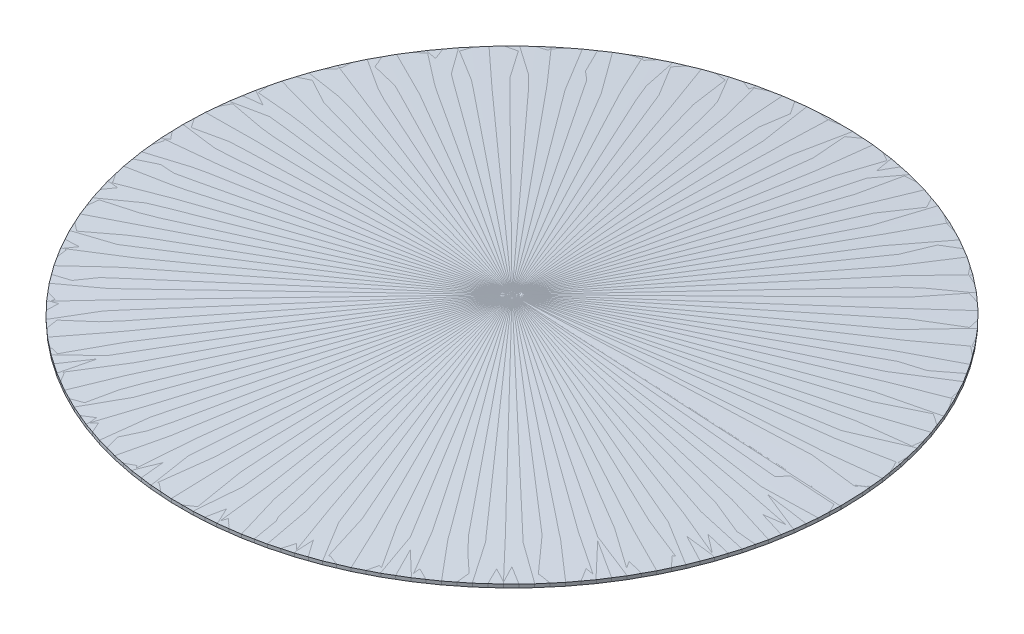
ISO-10303-21;
HEADER;
FILE_DESCRIPTION(('STEP AP214'),'2;1');
FILE_NAME('part.step','',(''),(''),'','','');
FILE_SCHEMA(('AUTOMOTIVE_DESIGN { 1 0 10303 214 1 1 1 1 }'));
ENDSEC;
DATA;
#1=APPLICATION_CONTEXT('core data for automotive mechanical design processes');
#2=APPLICATION_PROTOCOL_DEFINITION('international standard','automotive_design',2000,#1);
#3=PRODUCT_CONTEXT('',#1,'mechanical');
#4=PRODUCT('Part','Part','',(#3));
#5=PRODUCT_RELATED_PRODUCT_CATEGORY('part','',(#4));
#6=PRODUCT_DEFINITION_FORMATION('','',#4);
#7=PRODUCT_DEFINITION_CONTEXT('part definition',#1,'design');
#8=PRODUCT_DEFINITION('design','',#6,#7);
#9=PRODUCT_DEFINITION_SHAPE('','',#8);
#10=(LENGTH_UNIT() NAMED_UNIT(*) SI_UNIT(.MILLI.,.METRE.));
#11=(NAMED_UNIT(*) PLANE_ANGLE_UNIT() SI_UNIT($,.RADIAN.));
#12=(NAMED_UNIT(*) SI_UNIT($,.STERADIAN.) SOLID_ANGLE_UNIT());
#13=UNCERTAINTY_MEASURE_WITH_UNIT(LENGTH_MEASURE(1.E-05),#10,'distance_accuracy_value','');
#14=(GEOMETRIC_REPRESENTATION_CONTEXT(3) GLOBAL_UNCERTAINTY_ASSIGNED_CONTEXT((#13)) GLOBAL_UNIT_ASSIGNED_CONTEXT((#10,
#11,#12)) REPRESENTATION_CONTEXT('',''));
#15=CARTESIAN_POINT('',(0.,0.,0.));
#16=DIRECTION('',(0.,0.,1.));
#17=DIRECTION('',(1.,0.,0.));
#18=AXIS2_PLACEMENT_3D('',#15,#16,#17);
#19=CARTESIAN_POINT('',(0.,0.995884612293751,0.));
#20=DIRECTION('',(0.,1.,0.));
#21=DIRECTION('',(0.,0.,1.));
#22=AXIS2_PLACEMENT_3D('',#19,#20,#21);
#23=CONICAL_SURFACE('',#22,0.103542390211317,0.0535680057134327);
#24=DIRECTION('',(0.0535420640127607,0.998565577441191,0.00018689782016487));
#25=VECTOR('',#24,1.);
#26=CARTESIAN_POINT('',(0.103541759395643,0.995884612293751,0.000361430390925328));
#27=LINE('',#26,#25);
#28=CARTESIAN_POINT('',(0.0499996953828852,-0.00268096514743216,0.000174532570760525));
#29=VERTEX_POINT('',#28);
#30=CARTESIAN_POINT('',(0.157083823408427,1.99445018973495,0.000548328211090205));
#31=VERTEX_POINT('',#30);
#32=EDGE_CURVE('E12',#29,#31,#27,.T.);
#33=ORIENTED_EDGE('',*,*,#32,.F.);
#34=CARTESIAN_POINT('',(0.,-0.00268096514743216,0.));
#35=DIRECTION('',(0.,-1.,0.));
#36=DIRECTION('',(0.,0.,-1.));
#37=AXIS2_PLACEMENT_3D('',#34,#35,#36);
#38=CIRCLE('',#37,0.0499999999999945);
#39=CARTESIAN_POINT('',(0.0499999999999945,-0.00268096514743216,0.));
#40=VERTEX_POINT('',#39);
#41=EDGE_CURVE('E111',#29,#40,#38,.T.);
#42=ORIENTED_EDGE('',*,*,#41,.T.);
#43=DIRECTION('',(0.0535423902113246,0.998565577441191,0.));
#44=VECTOR('',#43,1.);
#45=CARTESIAN_POINT('',(0.10354239021131,0.995884612293752,0.));
#46=LINE('',#45,#44);
#47=CARTESIAN_POINT('',(0.157084780422645,1.99445018973495,0.));
#48=VERTEX_POINT('',#47);
#49=EDGE_CURVE('E59',#40,#48,#46,.T.);
#50=ORIENTED_EDGE('',*,*,#49,.T.);
#51=CARTESIAN_POINT('',(0.,1.99445018973495,0.));
#52=DIRECTION('',(0.,-1.,0.));
#53=DIRECTION('',(0.,0.,-1.));
#54=AXIS2_PLACEMENT_3D('',#51,#52,#53);
#55=CIRCLE('',#54,0.157084780422645);
#56=EDGE_CURVE('E105',#31,#48,#55,.T.);
#57=ORIENTED_EDGE('',*,*,#56,.F.);
#58=EDGE_LOOP('',(#33,#42,#50,#57));
#59=FACE_BOUND('',#58,.T.);
#60=ADVANCED_FACE('F49',(#59),#23,.F.);
#61=CARTESIAN_POINT('',(0.10354239021131,0.995884612293752,0.));
#62=DIRECTION('',(0.,0.,1.));
#63=DIRECTION('',(0.998565577441191,-0.0535423902113239,0.));
#64=AXIS2_PLACEMENT_3D('',#61,#62,#63);
#65=PLANE('',#64);
#66=ORIENTED_EDGE('',*,*,#49,.F.);
#67=DIRECTION('',(0.998565577441191,-0.0535423902113246,0.));
#68=VECTOR('',#67,1.);
#69=CARTESIAN_POINT('',(187.535423902113,-10.0555187078882,4.98546426034474E-12));
#70=LINE('',#69,#68);
#71=CARTESIAN_POINT('',(186.5,-10.0000000000001,4.95793842682015E-12));
#72=VERTEX_POINT('',#71);
#73=EDGE_CURVE('E93',#40,#72,#70,.T.);
#74=ORIENTED_EDGE('',*,*,#73,.T.);
#75=DIRECTION('',(0.0535423902113246,0.998565577441191,0.));
#76=VECTOR('',#75,1.);
#77=CARTESIAN_POINT('',(186.553542390211,-9.00143442255881,4.98220802401584E-12));
#78=LINE('',#77,#76);
#79=CARTESIAN_POINT('',(186.607084780423,-8.00286884511773,4.96078518149996E-12));
#80=VERTEX_POINT('',#79);
#81=EDGE_CURVE('E88',#72,#80,#78,.T.);
#82=ORIENTED_EDGE('',*,*,#81,.T.);
#83=DIRECTION('',(0.998565577441191,-0.0535423902113246,0.));
#84=VECTOR('',#83,1.);
#85=CARTESIAN_POINT('',(187.642508682536,-8.05838755300584,4.98831101502455E-12));
#86=LINE('',#85,#84);
#87=EDGE_CURVE('E91',#48,#80,#86,.T.);
#88=ORIENTED_EDGE('',*,*,#87,.F.);
#89=EDGE_LOOP('',(#66,#74,#82,#88));
#90=FACE_BOUND('',#89,.T.);
#91=ADVANCED_FACE('F90',(#90),#65,.T.);
#92=CARTESIAN_POINT('',(0.,-9.00143442255881,0.));
#93=DIRECTION('',(0.,1.,0.));
#94=DIRECTION('',(0.,0.,1.));
#95=AXIS2_PLACEMENT_3D('',#92,#93,#94);
#96=CONICAL_SURFACE('',#95,186.553542390211,0.0535680057134327);
#97=ORIENTED_EDGE('',*,*,#81,.F.);
#98=CARTESIAN_POINT('',(0.,-10.0000000000001,0.));
#99=DIRECTION('',(0.,-1.,0.));
#100=DIRECTION('',(0.,0.,-1.));
#101=AXIS2_PLACEMENT_3D('',#98,#99,#100);
#102=CIRCLE('',#101,186.5);
#103=CARTESIAN_POINT('',(186.498863778178,-10.0000000000001,0.651006488936565));
#104=VERTEX_POINT('',#103);
#105=EDGE_CURVE('E117',#72,#104,#102,.F.);
#106=ORIENTED_EDGE('',*,*,#105,.T.);
#107=DIRECTION('',(0.0535420640127607,0.998565577441191,0.000186897820164852));
#108=VECTOR('',#107,1.);
#109=CARTESIAN_POINT('',(186.552405842191,-9.00143442255881,0.651193386756711));
#110=LINE('',#109,#108);
#111=CARTESIAN_POINT('',(186.605947906203,-8.00286884511773,0.651380284576895));
#112=VERTEX_POINT('',#111);
#113=EDGE_CURVE('E53',#104,#112,#110,.T.);
#114=ORIENTED_EDGE('',*,*,#113,.T.);
#115=CARTESIAN_POINT('',(0.,-8.00286884511773,0.));
#116=DIRECTION('',(0.,-1.,0.));
#117=DIRECTION('',(0.,0.,-1.));
#118=AXIS2_PLACEMENT_3D('',#115,#116,#117);
#119=CIRCLE('',#118,186.607084780423);
#120=EDGE_CURVE('E104',#80,#112,#119,.F.);
#121=ORIENTED_EDGE('',*,*,#120,.F.);
#122=EDGE_LOOP('',(#97,#106,#114,#121));
#123=FACE_BOUND('',#122,.T.);
#124=ADVANCED_FACE('F107',(#123),#96,.T.);
#125=CARTESIAN_POINT('',(186.552405842191,-9.00143442255881,0.651193386756746));
#126=DIRECTION('',(0.00349065141520955,0.,-0.99999390765779));
#127=DIRECTION('',(-0.998559493837974,0.053542390211324,-0.00348564434607464));
#128=AXIS2_PLACEMENT_3D('',#125,#126,#127);
#129=PLANE('',#128);
#130=DIRECTION('',(0.998559493837974,-0.0535423902113246,0.00348564434607455));
#131=VECTOR('',#130,1.);
#132=CARTESIAN_POINT('',(187.534281372134,-10.0555187078882,0.654620792845819));
#133=LINE('',#132,#131);
#134=EDGE_CURVE('E109',#104,#29,#133,.F.);
#135=ORIENTED_EDGE('',*,*,#134,.T.);
#136=ORIENTED_EDGE('',*,*,#32,.T.);
#137=DIRECTION('',(0.998559493837974,-0.0535423902113246,0.00348564434607455));
#138=VECTOR('',#137,1.);
#139=CARTESIAN_POINT('',(187.64136550016,-8.05838755300584,0.654994588486148));
#140=LINE('',#139,#138);
#141=EDGE_CURVE('E115',#112,#31,#140,.F.);
#142=ORIENTED_EDGE('',*,*,#141,.F.);
#143=ORIENTED_EDGE('',*,*,#113,.F.);
#144=EDGE_LOOP('',(#135,#136,#142,#143));
#145=FACE_BOUND('',#144,.T.);
#146=ADVANCED_FACE('F51',(#145),#129,.T.);
#147=CARTESIAN_POINT('',(0.,-8.05838755300584,0.));
#148=DIRECTION('',(0.,-1.,0.));
#149=DIRECTION('',(0.,0.,-1.));
#150=AXIS2_PLACEMENT_3D('',#147,#148,#149);
#151=CONICAL_SURFACE('',#150,187.642508682536,1.51722832108146);
#152=ORIENTED_EDGE('',*,*,#120,.T.);
#153=ORIENTED_EDGE('',*,*,#141,.T.);
#154=ORIENTED_EDGE('',*,*,#56,.T.);
#155=ORIENTED_EDGE('',*,*,#87,.T.);
#156=EDGE_LOOP('',(#152,#153,#154,#155));
#157=FACE_BOUND('',#156,.T.);
#158=ADVANCED_FACE('F102',(#157),#151,.T.);
#159=CARTESIAN_POINT('',(0.,-10.0555187078882,0.));
#160=DIRECTION('',(0.,-1.,0.));
#161=DIRECTION('',(0.,0.,-1.));
#162=AXIS2_PLACEMENT_3D('',#159,#160,#161);
#163=CONICAL_SURFACE('',#162,187.535423902113,1.51722832108146);
#164=ORIENTED_EDGE('',*,*,#105,.F.);
#165=ORIENTED_EDGE('',*,*,#73,.F.);
#166=ORIENTED_EDGE('',*,*,#41,.F.);
#167=ORIENTED_EDGE('',*,*,#134,.F.);
#168=EDGE_LOOP('',(#164,#165,#166,#167));
#169=FACE_BOUND('',#168,.T.);
#170=ADVANCED_FACE('F122',(#169),#163,.F.);
#171=CLOSED_SHELL('',(#60,#91,#124,#146,#158,#170));
#172=MANIFOLD_SOLID_BREP('B2',#171);
#173=CARTESIAN_POINT('',(0.,0.,0.));
#174=DIRECTION('',(0.,-1.,0.));
#175=DIRECTION('',(1.,0.,0.));
#176=AXIS2_PLACEMENT_3D('',#173,#174,#175);
#177=CONICAL_SURFACE('',#176,0.,1.51722832108146);
#178=CARTESIAN_POINT('',(0.,-10.,0.));
#179=DIRECTION('',(0.,-1.,0.));
#180=DIRECTION('',(1.,0.,0.));
#181=AXIS2_PLACEMENT_3D('',#178,#179,#180);
#182=CIRCLE('',#181,186.5);
#183=CARTESIAN_POINT('',(186.5,-10.,0.));
#184=VERTEX_POINT('',#183);
#185=EDGE_CURVE('E47',#184,#184,#182,.T.);
#186=ORIENTED_EDGE('',*,*,#185,.T.);
#187=EDGE_LOOP('',(#186));
#188=FACE_BOUND('',#187,.T.);
#189=CARTESIAN_POINT('',(0.,0.,0.));
#190=VERTEX_POINT('',#189);
#191=VERTEX_LOOP('',#190);
#192=FACE_BOUND('',#191,.T.);
#193=ADVANCED_FACE('F184',(#188,#192),#177,.F.);
#194=CARTESIAN_POINT('',(0.,-10.,0.));
#195=DIRECTION('',(0.,1.,0.));
#196=DIRECTION('',(-1.,0.,0.));
#197=AXIS2_PLACEMENT_3D('',#194,#195,#196);
#198=CONICAL_SURFACE('',#197,186.5,0.0535680057134334);
#199=CARTESIAN_POINT('',(0.,-8.00286884511762,0.));
#200=DIRECTION('',(0.,-1.,0.));
#201=DIRECTION('',(1.,0.,0.));
#202=AXIS2_PLACEMENT_3D('',#199,#200,#201);
#203=CIRCLE('',#202,186.607084780423);
#204=CARTESIAN_POINT('',(186.607084780423,-8.00286884511762,0.));
#205=VERTEX_POINT('',#204);
#206=EDGE_CURVE('E191',#205,#205,#203,.T.);
#207=ORIENTED_EDGE('',*,*,#206,.T.);
#208=EDGE_LOOP('',(#207));
#209=FACE_BOUND('',#208,.T.);
#210=ORIENTED_EDGE('',*,*,#185,.F.);
#211=EDGE_LOOP('',(#210));
#212=FACE_BOUND('',#211,.T.);
#213=ADVANCED_FACE('F200',(#209,#212),#198,.T.);
#214=CARTESIAN_POINT('',(0.,-8.00286884511762,0.));
#215=DIRECTION('',(0.,-1.,0.));
#216=DIRECTION('',(1.,0.,0.));
#217=AXIS2_PLACEMENT_3D('',#214,#215,#216);
#218=CONICAL_SURFACE('',#217,186.607084780423,1.51722832108146);
#219=CARTESIAN_POINT('',(0.,2.00287296616503,0.));
#220=VERTEX_POINT('',#219);
#221=VERTEX_LOOP('',#220);
#222=FACE_BOUND('',#221,.T.);
#223=ORIENTED_EDGE('',*,*,#206,.F.);
#224=EDGE_LOOP('',(#223));
#225=FACE_BOUND('',#224,.T.);
#226=ADVANCED_FACE('F197',(#222,#225),#218,.T.);
#227=CLOSED_SHELL('',(#193,#213,#226));
#228=MANIFOLD_SOLID_BREP('B6_NOT_SHOWN',#227);
#229=ADVANCED_BREP_SHAPE_REPRESENTATION('',(#18,#172,#228),#14);
#230=SHAPE_DEFINITION_REPRESENTATION(#9,#229);
ENDSEC;
END-ISO-10303-21;
